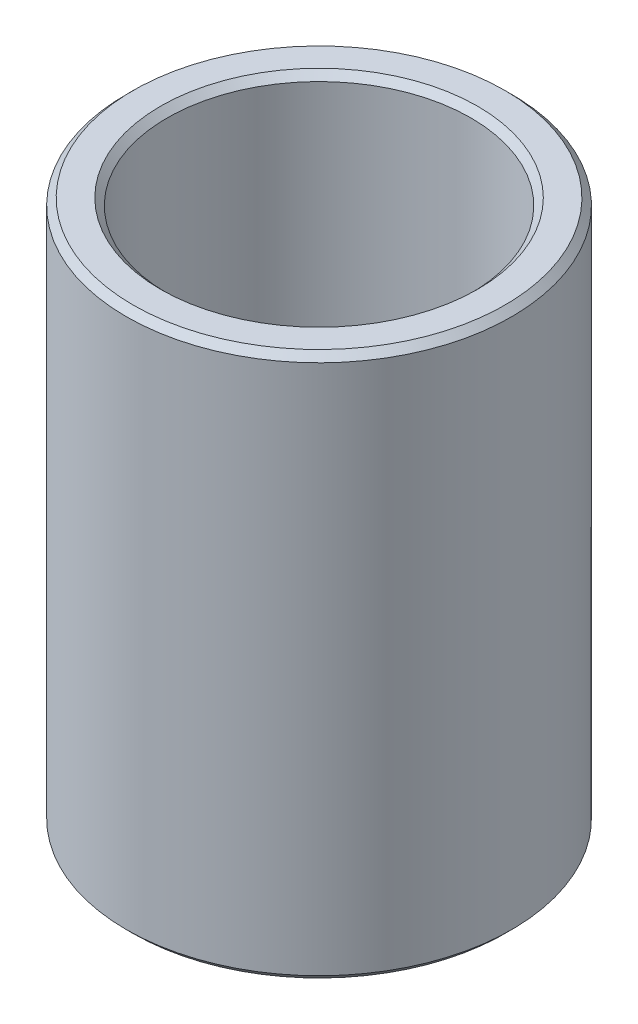
ISO-10303-21;
HEADER;
FILE_DESCRIPTION(('STEP AP214'),'2;1');
FILE_NAME('part.step','',(''),(''),'','','');
FILE_SCHEMA(('AUTOMOTIVE_DESIGN { 1 0 10303 214 1 1 1 1 }'));
ENDSEC;
DATA;
#1=APPLICATION_CONTEXT('core data for automotive mechanical design processes');
#2=APPLICATION_PROTOCOL_DEFINITION('international standard','automotive_design',2000,#1);
#3=PRODUCT_CONTEXT('',#1,'mechanical');
#4=PRODUCT('Part','Part','',(#3));
#5=PRODUCT_RELATED_PRODUCT_CATEGORY('part','',(#4));
#6=PRODUCT_DEFINITION_FORMATION('','',#4);
#7=PRODUCT_DEFINITION_CONTEXT('part definition',#1,'design');
#8=PRODUCT_DEFINITION('design','',#6,#7);
#9=PRODUCT_DEFINITION_SHAPE('','',#8);
#10=(LENGTH_UNIT() NAMED_UNIT(*) SI_UNIT(.MILLI.,.METRE.));
#11=(NAMED_UNIT(*) PLANE_ANGLE_UNIT() SI_UNIT($,.RADIAN.));
#12=(NAMED_UNIT(*) SI_UNIT($,.STERADIAN.) SOLID_ANGLE_UNIT());
#13=UNCERTAINTY_MEASURE_WITH_UNIT(LENGTH_MEASURE(1.E-05),#10,'distance_accuracy_value','');
#14=(GEOMETRIC_REPRESENTATION_CONTEXT(3) GLOBAL_UNCERTAINTY_ASSIGNED_CONTEXT((#13)) GLOBAL_UNIT_ASSIGNED_CONTEXT((#10,
#11,#12)) REPRESENTATION_CONTEXT('',''));
#15=CARTESIAN_POINT('',(0.,0.,0.));
#16=DIRECTION('',(0.,0.,1.));
#17=DIRECTION('',(1.,0.,0.));
#18=AXIS2_PLACEMENT_3D('',#15,#16,#17);
#19=CARTESIAN_POINT('',(0.,56.5095017643145,0.));
#20=DIRECTION('',(0.,-1.,0.));
#21=DIRECTION('',(0.,0.,-1.));
#22=AXIS2_PLACEMENT_3D('',#19,#20,#21);
#23=CYLINDRICAL_SURFACE('',#22,20.);
#24=CARTESIAN_POINT('',(0.,0.699719234270417,0.));
#25=DIRECTION('',(0.,1.,0.));
#26=DIRECTION('',(0.,0.,1.));
#27=AXIS2_PLACEMENT_3D('',#24,#25,#26);
#28=CIRCLE('',#27,20.);
#29=CARTESIAN_POINT('',(0.,0.699719234270417,20.));
#30=VERTEX_POINT('',#29);
#31=EDGE_CURVE('E10',#30,#30,#28,.T.);
#32=ORIENTED_EDGE('',*,*,#31,.T.);
#33=EDGE_LOOP('',(#32));
#34=FACE_BOUND('',#33,.T.);
#35=CARTESIAN_POINT('',(0.,55.8097825300441,0.));
#36=DIRECTION('',(0.,1.,0.));
#37=DIRECTION('',(0.,0.,1.));
#38=AXIS2_PLACEMENT_3D('',#35,#36,#37);
#39=CIRCLE('',#38,20.);
#40=CARTESIAN_POINT('',(0.,55.8097825300441,20.));
#41=VERTEX_POINT('',#40);
#42=EDGE_CURVE('E50',#41,#41,#39,.F.);
#43=ORIENTED_EDGE('',*,*,#42,.T.);
#44=EDGE_LOOP('',(#43));
#45=FACE_BOUND('',#44,.T.);
#46=ADVANCED_FACE('F39',(#34,#45),#23,.T.);
#47=CARTESIAN_POINT('',(0.,56.5095017643145,0.));
#48=DIRECTION('',(0.,1.,0.));
#49=DIRECTION('',(0.,0.,1.));
#50=AXIS2_PLACEMENT_3D('',#47,#48,#49);
#51=PLANE('',#50);
#52=CARTESIAN_POINT('',(0.,56.5095017643145,0.));
#53=DIRECTION('',(0.,1.,0.));
#54=DIRECTION('',(0.,0.,1.));
#55=AXIS2_PLACEMENT_3D('',#52,#53,#54);
#56=CIRCLE('',#55,16.4652439031792);
#57=CARTESIAN_POINT('',(0.,56.5095017643145,16.4652439031792));
#58=VERTEX_POINT('',#57);
#59=EDGE_CURVE('E58',#58,#58,#56,.F.);
#60=ORIENTED_EDGE('',*,*,#59,.T.);
#61=EDGE_LOOP('',(#60));
#62=FACE_BOUND('',#61,.T.);
#63=CARTESIAN_POINT('',(0.,56.5095017643145,0.));
#64=DIRECTION('',(0.,1.,0.));
#65=DIRECTION('',(0.,0.,1.));
#66=AXIS2_PLACEMENT_3D('',#63,#64,#65);
#67=CIRCLE('',#66,19.3002807657296);
#68=CARTESIAN_POINT('',(0.,56.5095017643145,19.3002807657296));
#69=VERTEX_POINT('',#68);
#70=EDGE_CURVE('E61',#69,#69,#67,.T.);
#71=ORIENTED_EDGE('',*,*,#70,.T.);
#72=EDGE_LOOP('',(#71));
#73=FACE_BOUND('',#72,.T.);
#74=ADVANCED_FACE('F88',(#62,#73),#51,.T.);
#75=CARTESIAN_POINT('',(0.,0.,0.));
#76=DIRECTION('',(0.,1.,0.));
#77=DIRECTION('',(0.,0.,1.));
#78=AXIS2_PLACEMENT_3D('',#75,#76,#77);
#79=PLANE('',#78);
#80=CARTESIAN_POINT('',(0.,0.,0.));
#81=DIRECTION('',(0.,1.,0.));
#82=DIRECTION('',(0.,0.,1.));
#83=AXIS2_PLACEMENT_3D('',#80,#81,#82);
#84=CIRCLE('',#83,16.4652439031792);
#85=CARTESIAN_POINT('',(0.,0.,16.4652439031792));
#86=VERTEX_POINT('',#85);
#87=EDGE_CURVE('E51',#86,#86,#84,.T.);
#88=ORIENTED_EDGE('',*,*,#87,.T.);
#89=EDGE_LOOP('',(#88));
#90=FACE_BOUND('',#89,.T.);
#91=CARTESIAN_POINT('',(0.,0.,0.));
#92=DIRECTION('',(0.,1.,0.));
#93=DIRECTION('',(0.,0.,1.));
#94=AXIS2_PLACEMENT_3D('',#91,#92,#93);
#95=CIRCLE('',#94,19.3002807657296);
#96=CARTESIAN_POINT('',(0.,0.,19.3002807657296));
#97=VERTEX_POINT('',#96);
#98=EDGE_CURVE('E54',#97,#97,#95,.F.);
#99=ORIENTED_EDGE('',*,*,#98,.T.);
#100=EDGE_LOOP('',(#99));
#101=FACE_BOUND('',#100,.T.);
#102=ADVANCED_FACE('F83',(#90,#101),#79,.F.);
#103=CARTESIAN_POINT('',(0.,56.5095017643145,0.));
#104=DIRECTION('',(0.,-1.,0.));
#105=DIRECTION('',(0.,0.,-1.));
#106=AXIS2_PLACEMENT_3D('',#103,#104,#105);
#107=CYLINDRICAL_SURFACE('',#106,15.7655246689088);
#108=CARTESIAN_POINT('',(0.,55.8097825300441,0.));
#109=DIRECTION('',(0.,1.,0.));
#110=DIRECTION('',(0.,0.,1.));
#111=AXIS2_PLACEMENT_3D('',#108,#109,#110);
#112=CIRCLE('',#111,15.7655246689088);
#113=CARTESIAN_POINT('',(0.,55.8097825300441,15.7655246689088));
#114=VERTEX_POINT('',#113);
#115=EDGE_CURVE('E67',#114,#114,#112,.T.);
#116=ORIENTED_EDGE('',*,*,#115,.T.);
#117=EDGE_LOOP('',(#116));
#118=FACE_BOUND('',#117,.T.);
#119=CARTESIAN_POINT('',(0.,0.699719234270445,0.));
#120=DIRECTION('',(0.,1.,0.));
#121=DIRECTION('',(0.,0.,1.));
#122=AXIS2_PLACEMENT_3D('',#119,#120,#121);
#123=CIRCLE('',#122,15.7655246689088);
#124=CARTESIAN_POINT('',(0.,0.699719234270445,15.7655246689088));
#125=VERTEX_POINT('',#124);
#126=EDGE_CURVE('E69',#125,#125,#123,.F.);
#127=ORIENTED_EDGE('',*,*,#126,.T.);
#128=EDGE_LOOP('',(#127));
#129=FACE_BOUND('',#128,.T.);
#130=ADVANCED_FACE('F71',(#118,#129),#107,.F.);
#131=CARTESIAN_POINT('',(0.,55.8097825300441,0.));
#132=DIRECTION('',(0.,1.,0.));
#133=DIRECTION('',(0.,0.,1.));
#134=AXIS2_PLACEMENT_3D('',#131,#132,#133);
#135=CONICAL_SURFACE('',#134,15.7655246689088,0.785398163397451);
#136=ORIENTED_EDGE('',*,*,#59,.F.);
#137=EDGE_LOOP('',(#136));
#138=FACE_BOUND('',#137,.T.);
#139=ORIENTED_EDGE('',*,*,#115,.F.);
#140=EDGE_LOOP('',(#139));
#141=FACE_BOUND('',#140,.T.);
#142=ADVANCED_FACE('F77',(#138,#141),#135,.F.);
#143=CARTESIAN_POINT('',(0.,0.,0.));
#144=DIRECTION('',(0.,-1.,0.));
#145=DIRECTION('',(0.,0.,-1.));
#146=AXIS2_PLACEMENT_3D('',#143,#144,#145);
#147=CONICAL_SURFACE('',#146,16.4652439031792,0.785398163397441);
#148=ORIENTED_EDGE('',*,*,#126,.F.);
#149=EDGE_LOOP('',(#148));
#150=FACE_BOUND('',#149,.T.);
#151=ORIENTED_EDGE('',*,*,#87,.F.);
#152=EDGE_LOOP('',(#151));
#153=FACE_BOUND('',#152,.T.);
#154=ADVANCED_FACE('F73',(#150,#153),#147,.F.);
#155=CARTESIAN_POINT('',(0.,0.699719234270417,0.));
#156=DIRECTION('',(0.,1.,0.));
#157=DIRECTION('',(0.,0.,1.));
#158=AXIS2_PLACEMENT_3D('',#155,#156,#157);
#159=CONICAL_SURFACE('',#158,20.,0.785398163397451);
#160=ORIENTED_EDGE('',*,*,#98,.F.);
#161=EDGE_LOOP('',(#160));
#162=FACE_BOUND('',#161,.T.);
#163=ORIENTED_EDGE('',*,*,#31,.F.);
#164=EDGE_LOOP('',(#163));
#165=FACE_BOUND('',#164,.T.);
#166=ADVANCED_FACE('F76',(#162,#165),#159,.T.);
#167=CARTESIAN_POINT('',(0.,56.5095017643145,0.));
#168=DIRECTION('',(0.,-1.,0.));
#169=DIRECTION('',(0.,0.,-1.));
#170=AXIS2_PLACEMENT_3D('',#167,#168,#169);
#171=CONICAL_SURFACE('',#170,19.3002807657296,0.785398163397436);
#172=ORIENTED_EDGE('',*,*,#42,.F.);
#173=EDGE_LOOP('',(#172));
#174=FACE_BOUND('',#173,.T.);
#175=ORIENTED_EDGE('',*,*,#70,.F.);
#176=EDGE_LOOP('',(#175));
#177=FACE_BOUND('',#176,.T.);
#178=ADVANCED_FACE('F45',(#174,#177),#171,.T.);
#179=CLOSED_SHELL('',(#46,#74,#102,#130,#142,#154,#166,#178));
#180=MANIFOLD_SOLID_BREP('B2',#179);
#181=ADVANCED_BREP_SHAPE_REPRESENTATION('',(#18,#180),#14);
#182=SHAPE_DEFINITION_REPRESENTATION(#9,#181);
ENDSEC;
END-ISO-10303-21;
